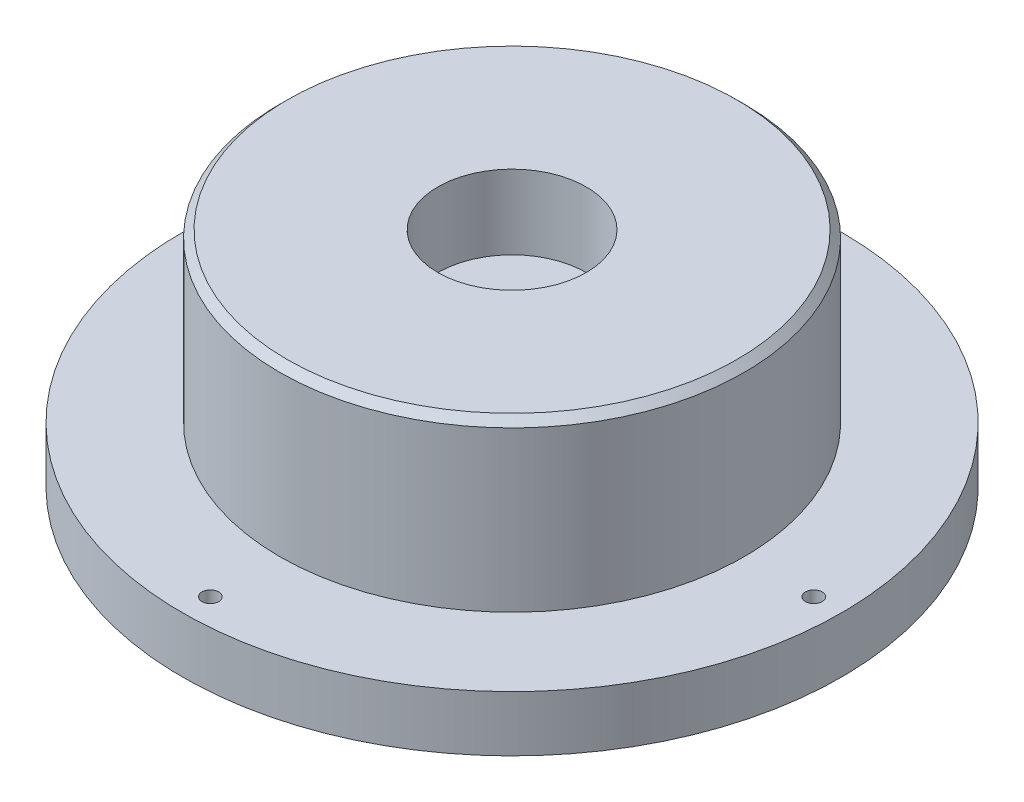
ISO-10303-21;
HEADER;
FILE_DESCRIPTION(('STEP AP214'),'2;1');
FILE_NAME('part.step','',(''),(''),'','','');
FILE_SCHEMA(('AUTOMOTIVE_DESIGN { 1 0 10303 214 1 1 1 1 }'));
ENDSEC;
DATA;
#1=APPLICATION_CONTEXT('core data for automotive mechanical design processes');
#2=APPLICATION_PROTOCOL_DEFINITION('international standard','automotive_design',2000,#1);
#3=PRODUCT_CONTEXT('',#1,'mechanical');
#4=PRODUCT('Part','Part','',(#3));
#5=PRODUCT_RELATED_PRODUCT_CATEGORY('part','',(#4));
#6=PRODUCT_DEFINITION_FORMATION('','',#4);
#7=PRODUCT_DEFINITION_CONTEXT('part definition',#1,'design');
#8=PRODUCT_DEFINITION('design','',#6,#7);
#9=PRODUCT_DEFINITION_SHAPE('','',#8);
#10=(LENGTH_UNIT() NAMED_UNIT(*) SI_UNIT(.MILLI.,.METRE.));
#11=(NAMED_UNIT(*) PLANE_ANGLE_UNIT() SI_UNIT($,.RADIAN.));
#12=(NAMED_UNIT(*) SI_UNIT($,.STERADIAN.) SOLID_ANGLE_UNIT());
#13=UNCERTAINTY_MEASURE_WITH_UNIT(LENGTH_MEASURE(1.E-05),#10,'distance_accuracy_value','');
#14=(GEOMETRIC_REPRESENTATION_CONTEXT(3) GLOBAL_UNCERTAINTY_ASSIGNED_CONTEXT((#13)) GLOBAL_UNIT_ASSIGNED_CONTEXT((#10,
#11,#12)) REPRESENTATION_CONTEXT('',''));
#15=CARTESIAN_POINT('',(0.,0.,0.));
#16=DIRECTION('',(0.,0.,1.));
#17=DIRECTION('',(1.,0.,0.));
#18=AXIS2_PLACEMENT_3D('',#15,#16,#17);
#19=CARTESIAN_POINT('',(0.,28.575,0.));
#20=DIRECTION('',(0.,-1.,0.));
#21=DIRECTION('',(0.,0.,-1.));
#22=AXIS2_PLACEMENT_3D('',#19,#20,#21);
#23=CYLINDRICAL_SURFACE('',#22,39.749984);
#24=CARTESIAN_POINT('',(0.,27.305,0.));
#25=DIRECTION('',(0.,1.,0.));
#26=DIRECTION('',(0.,0.,1.));
#27=AXIS2_PLACEMENT_3D('',#24,#25,#26);
#28=CIRCLE('',#27,39.749984);
#29=CARTESIAN_POINT('',(0.,27.305,39.749984));
#30=VERTEX_POINT('',#29);
#31=EDGE_CURVE('E10',#30,#30,#28,.F.);
#32=ORIENTED_EDGE('',*,*,#31,.T.);
#33=EDGE_LOOP('',(#32));
#34=FACE_BOUND('',#33,.T.);
#35=CARTESIAN_POINT('',(0.,0.,0.));
#36=DIRECTION('',(0.,1.,0.));
#37=DIRECTION('',(0.,0.,1.));
#38=AXIS2_PLACEMENT_3D('',#35,#36,#37);
#39=CIRCLE('',#38,39.749984);
#40=CARTESIAN_POINT('',(0.,0.,39.749984));
#41=VERTEX_POINT('',#40);
#42=EDGE_CURVE('E50',#41,#41,#39,.T.);
#43=ORIENTED_EDGE('',*,*,#42,.T.);
#44=EDGE_LOOP('',(#43));
#45=FACE_BOUND('',#44,.T.);
#46=ADVANCED_FACE('F37',(#34,#45),#23,.T.);
#47=CARTESIAN_POINT('',(0.,28.575,0.));
#48=DIRECTION('',(0.,1.,0.));
#49=DIRECTION('',(0.,0.,1.));
#50=AXIS2_PLACEMENT_3D('',#47,#48,#49);
#51=PLANE('',#50);
#52=CARTESIAN_POINT('',(0.,28.575,0.));
#53=DIRECTION('',(0.,1.,0.));
#54=DIRECTION('',(0.,0.,1.));
#55=AXIS2_PLACEMENT_3D('',#52,#53,#54);
#56=CIRCLE('',#55,12.7);
#57=CARTESIAN_POINT('',(0.,28.575,12.7));
#58=VERTEX_POINT('',#57);
#59=EDGE_CURVE('E98',#58,#58,#56,.T.);
#60=ORIENTED_EDGE('',*,*,#59,.F.);
#61=EDGE_LOOP('',(#60));
#62=FACE_BOUND('',#61,.T.);
#63=CARTESIAN_POINT('',(0.,28.575,0.));
#64=DIRECTION('',(0.,1.,0.));
#65=DIRECTION('',(0.,0.,1.));
#66=AXIS2_PLACEMENT_3D('',#63,#64,#65);
#67=CIRCLE('',#66,38.479984);
#68=CARTESIAN_POINT('',(0.,28.575,38.479984));
#69=VERTEX_POINT('',#68);
#70=EDGE_CURVE('E45',#69,#69,#67,.T.);
#71=ORIENTED_EDGE('',*,*,#70,.T.);
#72=EDGE_LOOP('',(#71));
#73=FACE_BOUND('',#72,.T.);
#74=ADVANCED_FACE('F115',(#62,#73),#51,.T.);
#75=CARTESIAN_POINT('',(0.,-9.525,0.));
#76=DIRECTION('',(0.,1.,0.));
#77=DIRECTION('',(0.,0.,1.));
#78=AXIS2_PLACEMENT_3D('',#75,#76,#77);
#79=CYLINDRICAL_SURFACE('',#78,56.388);
#80=CARTESIAN_POINT('',(0.,-9.525,0.));
#81=DIRECTION('',(0.,-1.,0.));
#82=DIRECTION('',(0.,0.,-1.));
#83=AXIS2_PLACEMENT_3D('',#80,#81,#82);
#84=CIRCLE('',#83,56.388);
#85=CARTESIAN_POINT('',(0.,-9.525,-56.388));
#86=VERTEX_POINT('',#85);
#87=EDGE_CURVE('E55',#86,#86,#84,.T.);
#88=ORIENTED_EDGE('',*,*,#87,.F.);
#89=EDGE_LOOP('',(#88));
#90=FACE_BOUND('',#89,.T.);
#91=CARTESIAN_POINT('',(0.,0.,0.));
#92=DIRECTION('',(0.,-1.,0.));
#93=DIRECTION('',(0.,0.,-1.));
#94=AXIS2_PLACEMENT_3D('',#91,#92,#93);
#95=CIRCLE('',#94,56.388);
#96=CARTESIAN_POINT('',(0.,0.,-56.388));
#97=VERTEX_POINT('',#96);
#98=EDGE_CURVE('E58',#97,#97,#95,.T.);
#99=ORIENTED_EDGE('',*,*,#98,.T.);
#100=EDGE_LOOP('',(#99));
#101=FACE_BOUND('',#100,.T.);
#102=ADVANCED_FACE('F117',(#90,#101),#79,.T.);
#103=CARTESIAN_POINT('',(0.,-9.525,0.));
#104=DIRECTION('',(0.,-1.,0.));
#105=DIRECTION('',(0.,0.,-1.));
#106=AXIS2_PLACEMENT_3D('',#103,#104,#105);
#107=PLANE('',#106);
#108=CARTESIAN_POINT('',(0.,-9.525,-51.6255));
#109=DIRECTION('',(0.,1.,0.));
#110=DIRECTION('',(0.,0.,1.));
#111=AXIS2_PLACEMENT_3D('',#108,#109,#110);
#112=CIRCLE('',#111,1.4351);
#113=CARTESIAN_POINT('',(0.,-9.525,-50.1904));
#114=VERTEX_POINT('',#113);
#115=EDGE_CURVE('E89',#114,#114,#112,.T.);
#116=ORIENTED_EDGE('',*,*,#115,.T.);
#117=EDGE_LOOP('',(#116));
#118=FACE_BOUND('',#117,.T.);
#119=CARTESIAN_POINT('',(51.6255,-9.525,0.));
#120=DIRECTION('',(0.,1.,0.));
#121=DIRECTION('',(0.,0.,1.));
#122=AXIS2_PLACEMENT_3D('',#119,#120,#121);
#123=CIRCLE('',#122,1.43509999999999);
#124=CARTESIAN_POINT('',(51.6255,-9.525,1.43509999999999));
#125=VERTEX_POINT('',#124);
#126=EDGE_CURVE('E81',#125,#125,#123,.T.);
#127=ORIENTED_EDGE('',*,*,#126,.T.);
#128=EDGE_LOOP('',(#127));
#129=FACE_BOUND('',#128,.T.);
#130=CARTESIAN_POINT('',(0.,-9.525,51.6255));
#131=DIRECTION('',(0.,1.,0.));
#132=DIRECTION('',(0.,0.,1.));
#133=AXIS2_PLACEMENT_3D('',#130,#131,#132);
#134=CIRCLE('',#133,1.4351);
#135=CARTESIAN_POINT('',(0.,-9.525,53.0606));
#136=VERTEX_POINT('',#135);
#137=EDGE_CURVE('E73',#136,#136,#134,.T.);
#138=ORIENTED_EDGE('',*,*,#137,.T.);
#139=EDGE_LOOP('',(#138));
#140=FACE_BOUND('',#139,.T.);
#141=CARTESIAN_POINT('',(-51.6255,-9.525,0.));
#142=DIRECTION('',(0.,1.,0.));
#143=DIRECTION('',(0.,0.,1.));
#144=AXIS2_PLACEMENT_3D('',#141,#142,#143);
#145=CIRCLE('',#144,1.43509999999999);
#146=CARTESIAN_POINT('',(-51.6255,-9.525,1.43509999999999));
#147=VERTEX_POINT('',#146);
#148=EDGE_CURVE('E62',#147,#147,#145,.T.);
#149=ORIENTED_EDGE('',*,*,#148,.T.);
#150=EDGE_LOOP('',(#149));
#151=FACE_BOUND('',#150,.T.);
#152=ORIENTED_EDGE('',*,*,#87,.T.);
#153=EDGE_LOOP('',(#152));
#154=FACE_BOUND('',#153,.T.);
#155=ADVANCED_FACE('F123',(#118,#129,#140,#151,#154),#107,.T.);
#156=CARTESIAN_POINT('',(0.,0.,0.));
#157=DIRECTION('',(0.,-1.,0.));
#158=DIRECTION('',(0.,0.,-1.));
#159=AXIS2_PLACEMENT_3D('',#156,#157,#158);
#160=PLANE('',#159);
#161=CARTESIAN_POINT('',(0.,0.,-51.6255));
#162=DIRECTION('',(0.,1.,0.));
#163=DIRECTION('',(0.,0.,1.));
#164=AXIS2_PLACEMENT_3D('',#161,#162,#163);
#165=CIRCLE('',#164,1.43509999999999);
#166=CARTESIAN_POINT('',(0.,0.,-50.1904));
#167=VERTEX_POINT('',#166);
#168=EDGE_CURVE('E93',#167,#167,#165,.T.);
#169=ORIENTED_EDGE('',*,*,#168,.F.);
#170=EDGE_LOOP('',(#169));
#171=FACE_BOUND('',#170,.T.);
#172=CARTESIAN_POINT('',(51.6255,0.,0.));
#173=DIRECTION('',(0.,1.,0.));
#174=DIRECTION('',(0.,0.,1.));
#175=AXIS2_PLACEMENT_3D('',#172,#173,#174);
#176=CIRCLE('',#175,1.43509999999999);
#177=CARTESIAN_POINT('',(51.6255,0.,1.43509999999999));
#178=VERTEX_POINT('',#177);
#179=EDGE_CURVE('E85',#178,#178,#176,.T.);
#180=ORIENTED_EDGE('',*,*,#179,.F.);
#181=EDGE_LOOP('',(#180));
#182=FACE_BOUND('',#181,.T.);
#183=CARTESIAN_POINT('',(0.,0.,51.6255));
#184=DIRECTION('',(0.,1.,0.));
#185=DIRECTION('',(0.,0.,1.));
#186=AXIS2_PLACEMENT_3D('',#183,#184,#185);
#187=CIRCLE('',#186,1.43509999999999);
#188=CARTESIAN_POINT('',(0.,0.,53.0606));
#189=VERTEX_POINT('',#188);
#190=EDGE_CURVE('E77',#189,#189,#187,.T.);
#191=ORIENTED_EDGE('',*,*,#190,.F.);
#192=EDGE_LOOP('',(#191));
#193=FACE_BOUND('',#192,.T.);
#194=CARTESIAN_POINT('',(-51.6255,0.,0.));
#195=DIRECTION('',(0.,1.,0.));
#196=DIRECTION('',(0.,0.,1.));
#197=AXIS2_PLACEMENT_3D('',#194,#195,#196);
#198=CIRCLE('',#197,1.43509999999999);
#199=CARTESIAN_POINT('',(-51.6255,0.,1.43509999999999));
#200=VERTEX_POINT('',#199);
#201=EDGE_CURVE('E69',#200,#200,#198,.T.);
#202=ORIENTED_EDGE('',*,*,#201,.F.);
#203=EDGE_LOOP('',(#202));
#204=FACE_BOUND('',#203,.T.);
#205=ORIENTED_EDGE('',*,*,#42,.F.);
#206=EDGE_LOOP('',(#205));
#207=FACE_BOUND('',#206,.T.);
#208=ORIENTED_EDGE('',*,*,#98,.F.);
#209=EDGE_LOOP('',(#208));
#210=FACE_BOUND('',#209,.T.);
#211=ADVANCED_FACE('F127',(#171,#182,#193,#204,#207,#210),#160,.F.);
#212=CARTESIAN_POINT('',(0.,28.575,0.));
#213=DIRECTION('',(0.,-1.,0.));
#214=DIRECTION('',(0.,0.,-1.));
#215=AXIS2_PLACEMENT_3D('',#212,#213,#214);
#216=CONICAL_SURFACE('',#215,38.479984,0.78539816339744);
#217=ORIENTED_EDGE('',*,*,#31,.F.);
#218=EDGE_LOOP('',(#217));
#219=FACE_BOUND('',#218,.T.);
#220=ORIENTED_EDGE('',*,*,#70,.F.);
#221=EDGE_LOOP('',(#220));
#222=FACE_BOUND('',#221,.T.);
#223=ADVANCED_FACE('F39',(#219,#222),#216,.T.);
#224=CARTESIAN_POINT('',(-51.6255,0.,0.));
#225=DIRECTION('',(0.,1.,0.));
#226=DIRECTION('',(0.,0.,1.));
#227=AXIS2_PLACEMENT_3D('',#224,#225,#226);
#228=CYLINDRICAL_SURFACE('',#227,1.43509999999999);
#229=ORIENTED_EDGE('',*,*,#148,.F.);
#230=EDGE_LOOP('',(#229));
#231=FACE_BOUND('',#230,.T.);
#232=ORIENTED_EDGE('',*,*,#201,.T.);
#233=EDGE_LOOP('',(#232));
#234=FACE_BOUND('',#233,.T.);
#235=ADVANCED_FACE('F134',(#231,#234),#228,.F.);
#236=CARTESIAN_POINT('',(0.,0.,51.6255));
#237=DIRECTION('',(0.,1.,0.));
#238=DIRECTION('',(0.,0.,1.));
#239=AXIS2_PLACEMENT_3D('',#236,#237,#238);
#240=CYLINDRICAL_SURFACE('',#239,1.43509999999999);
#241=ORIENTED_EDGE('',*,*,#137,.F.);
#242=EDGE_LOOP('',(#241));
#243=FACE_BOUND('',#242,.T.);
#244=ORIENTED_EDGE('',*,*,#190,.T.);
#245=EDGE_LOOP('',(#244));
#246=FACE_BOUND('',#245,.T.);
#247=ADVANCED_FACE('F137',(#243,#246),#240,.F.);
#248=CARTESIAN_POINT('',(51.6255,0.,0.));
#249=DIRECTION('',(0.,1.,0.));
#250=DIRECTION('',(0.,0.,1.));
#251=AXIS2_PLACEMENT_3D('',#248,#249,#250);
#252=CYLINDRICAL_SURFACE('',#251,1.43509999999999);
#253=ORIENTED_EDGE('',*,*,#126,.F.);
#254=EDGE_LOOP('',(#253));
#255=FACE_BOUND('',#254,.T.);
#256=ORIENTED_EDGE('',*,*,#179,.T.);
#257=EDGE_LOOP('',(#256));
#258=FACE_BOUND('',#257,.T.);
#259=ADVANCED_FACE('F141',(#255,#258),#252,.F.);
#260=CARTESIAN_POINT('',(0.,0.,-51.6255));
#261=DIRECTION('',(0.,1.,0.));
#262=DIRECTION('',(0.,0.,1.));
#263=AXIS2_PLACEMENT_3D('',#260,#261,#262);
#264=CYLINDRICAL_SURFACE('',#263,1.43509999999999);
#265=ORIENTED_EDGE('',*,*,#115,.F.);
#266=EDGE_LOOP('',(#265));
#267=FACE_BOUND('',#266,.T.);
#268=ORIENTED_EDGE('',*,*,#168,.T.);
#269=EDGE_LOOP('',(#268));
#270=FACE_BOUND('',#269,.T.);
#271=ADVANCED_FACE('F111',(#267,#270),#264,.F.);
#272=CARTESIAN_POINT('',(0.,15.875,0.));
#273=DIRECTION('',(0.,1.,0.));
#274=DIRECTION('',(0.,0.,1.));
#275=AXIS2_PLACEMENT_3D('',#272,#273,#274);
#276=CYLINDRICAL_SURFACE('',#275,12.7);
#277=CARTESIAN_POINT('',(0.,15.875,0.));
#278=DIRECTION('',(0.,1.,0.));
#279=DIRECTION('',(0.,0.,1.));
#280=AXIS2_PLACEMENT_3D('',#277,#278,#279);
#281=CIRCLE('',#280,12.7);
#282=CARTESIAN_POINT('',(0.,15.875,12.7));
#283=VERTEX_POINT('',#282);
#284=EDGE_CURVE('E97',#283,#283,#281,.T.);
#285=ORIENTED_EDGE('',*,*,#284,.F.);
#286=EDGE_LOOP('',(#285));
#287=FACE_BOUND('',#286,.T.);
#288=ORIENTED_EDGE('',*,*,#59,.T.);
#289=EDGE_LOOP('',(#288));
#290=FACE_BOUND('',#289,.T.);
#291=ADVANCED_FACE('F108',(#287,#290),#276,.F.);
#292=CARTESIAN_POINT('',(0.,15.875,0.));
#293=DIRECTION('',(0.,1.,0.));
#294=DIRECTION('',(0.,0.,1.));
#295=AXIS2_PLACEMENT_3D('',#292,#293,#294);
#296=PLANE('',#295);
#297=ORIENTED_EDGE('',*,*,#284,.T.);
#298=EDGE_LOOP('',(#297));
#299=FACE_BOUND('',#298,.T.);
#300=ADVANCED_FACE('F106',(#299),#296,.T.);
#301=CLOSED_SHELL('',(#46,#74,#102,#155,#211,#223,#235,#247,#259,#271,#291,#300));
#302=MANIFOLD_SOLID_BREP('B2',#301);
#303=ADVANCED_BREP_SHAPE_REPRESENTATION('',(#18,#302),#14);
#304=SHAPE_DEFINITION_REPRESENTATION(#9,#303);
ENDSEC;
END-ISO-10303-21;
